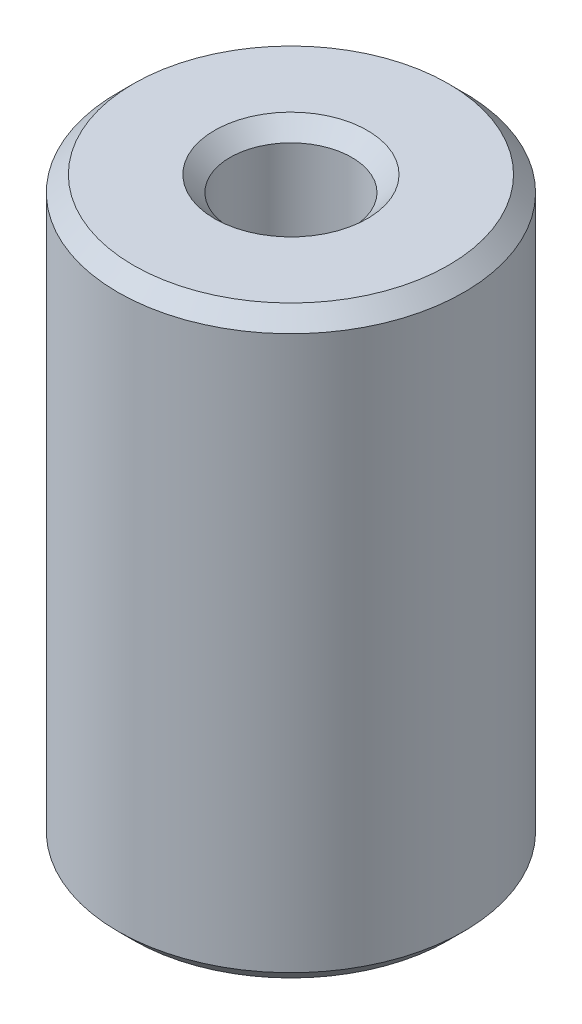
ISO-10303-21;
HEADER;
FILE_DESCRIPTION(('STEP AP214'),'2;1');
FILE_NAME('part.step','',(''),(''),'','','');
FILE_SCHEMA(('AUTOMOTIVE_DESIGN { 1 0 10303 214 1 1 1 1 }'));
ENDSEC;
DATA;
#1=APPLICATION_CONTEXT('core data for automotive mechanical design processes');
#2=APPLICATION_PROTOCOL_DEFINITION('international standard','automotive_design',2000,#1);
#3=PRODUCT_CONTEXT('',#1,'mechanical');
#4=PRODUCT('Part','Part','',(#3));
#5=PRODUCT_RELATED_PRODUCT_CATEGORY('part','',(#4));
#6=PRODUCT_DEFINITION_FORMATION('','',#4);
#7=PRODUCT_DEFINITION_CONTEXT('part definition',#1,'design');
#8=PRODUCT_DEFINITION('design','',#6,#7);
#9=PRODUCT_DEFINITION_SHAPE('','',#8);
#10=(LENGTH_UNIT() NAMED_UNIT(*) SI_UNIT(.MILLI.,.METRE.));
#11=(NAMED_UNIT(*) PLANE_ANGLE_UNIT() SI_UNIT($,.RADIAN.));
#12=(NAMED_UNIT(*) SI_UNIT($,.STERADIAN.) SOLID_ANGLE_UNIT());
#13=UNCERTAINTY_MEASURE_WITH_UNIT(LENGTH_MEASURE(1.E-05),#10,'distance_accuracy_value','');
#14=(GEOMETRIC_REPRESENTATION_CONTEXT(3) GLOBAL_UNCERTAINTY_ASSIGNED_CONTEXT((#13)) GLOBAL_UNIT_ASSIGNED_CONTEXT((#10,
#11,#12)) REPRESENTATION_CONTEXT('',''));
#15=CARTESIAN_POINT('',(0.,0.,0.));
#16=DIRECTION('',(0.,0.,1.));
#17=DIRECTION('',(1.,0.,0.));
#18=AXIS2_PLACEMENT_3D('',#15,#16,#17);
#19=CARTESIAN_POINT('',(0.,16.8949019545531,0.));
#20=DIRECTION('',(0.,-1.,0.));
#21=DIRECTION('',(0.,0.,-1.));
#22=AXIS2_PLACEMENT_3D('',#19,#20,#21);
#23=CYLINDRICAL_SURFACE('',#22,5.);
#24=CARTESIAN_POINT('',(0.,0.450390786111501,0.));
#25=DIRECTION('',(0.,1.,0.));
#26=DIRECTION('',(0.,0.,1.));
#27=AXIS2_PLACEMENT_3D('',#24,#25,#26);
#28=CIRCLE('',#27,5.);
#29=CARTESIAN_POINT('',(0.,0.450390786111501,5.));
#30=VERTEX_POINT('',#29);
#31=EDGE_CURVE('E10',#30,#30,#28,.T.);
#32=ORIENTED_EDGE('',*,*,#31,.T.);
#33=EDGE_LOOP('',(#32));
#34=FACE_BOUND('',#33,.T.);
#35=CARTESIAN_POINT('',(0.,16.4445111684416,0.));
#36=DIRECTION('',(0.,1.,0.));
#37=DIRECTION('',(0.,0.,1.));
#38=AXIS2_PLACEMENT_3D('',#35,#36,#37);
#39=CIRCLE('',#38,5.);
#40=CARTESIAN_POINT('',(0.,16.4445111684416,5.));
#41=VERTEX_POINT('',#40);
#42=EDGE_CURVE('E50',#41,#41,#39,.F.);
#43=ORIENTED_EDGE('',*,*,#42,.T.);
#44=EDGE_LOOP('',(#43));
#45=FACE_BOUND('',#44,.T.);
#46=ADVANCED_FACE('F39',(#34,#45),#23,.T.);
#47=CARTESIAN_POINT('',(0.,16.8949019545531,0.));
#48=DIRECTION('',(0.,1.,0.));
#49=DIRECTION('',(0.,0.,1.));
#50=AXIS2_PLACEMENT_3D('',#47,#48,#49);
#51=PLANE('',#50);
#52=CARTESIAN_POINT('',(0.,16.8949019545531,0.));
#53=DIRECTION('',(0.,1.,0.));
#54=DIRECTION('',(0.,0.,1.));
#55=AXIS2_PLACEMENT_3D('',#52,#53,#54);
#56=CIRCLE('',#55,2.20968163826328);
#57=CARTESIAN_POINT('',(0.,16.8949019545531,2.20968163826328));
#58=VERTEX_POINT('',#57);
#59=EDGE_CURVE('E58',#58,#58,#56,.F.);
#60=ORIENTED_EDGE('',*,*,#59,.T.);
#61=EDGE_LOOP('',(#60));
#62=FACE_BOUND('',#61,.T.);
#63=CARTESIAN_POINT('',(0.,16.8949019545531,0.));
#64=DIRECTION('',(0.,1.,0.));
#65=DIRECTION('',(0.,0.,1.));
#66=AXIS2_PLACEMENT_3D('',#63,#64,#65);
#67=CIRCLE('',#66,4.5496092138885);
#68=CARTESIAN_POINT('',(0.,16.8949019545531,4.5496092138885));
#69=VERTEX_POINT('',#68);
#70=EDGE_CURVE('E61',#69,#69,#67,.T.);
#71=ORIENTED_EDGE('',*,*,#70,.T.);
#72=EDGE_LOOP('',(#71));
#73=FACE_BOUND('',#72,.T.);
#74=ADVANCED_FACE('F88',(#62,#73),#51,.T.);
#75=CARTESIAN_POINT('',(0.,0.,0.));
#76=DIRECTION('',(0.,1.,0.));
#77=DIRECTION('',(0.,0.,1.));
#78=AXIS2_PLACEMENT_3D('',#75,#76,#77);
#79=PLANE('',#78);
#80=CARTESIAN_POINT('',(0.,0.,0.));
#81=DIRECTION('',(0.,1.,0.));
#82=DIRECTION('',(0.,0.,1.));
#83=AXIS2_PLACEMENT_3D('',#80,#81,#82);
#84=CIRCLE('',#83,2.20968163826329);
#85=CARTESIAN_POINT('',(0.,0.,2.20968163826329));
#86=VERTEX_POINT('',#85);
#87=EDGE_CURVE('E51',#86,#86,#84,.T.);
#88=ORIENTED_EDGE('',*,*,#87,.T.);
#89=EDGE_LOOP('',(#88));
#90=FACE_BOUND('',#89,.T.);
#91=CARTESIAN_POINT('',(0.,0.,0.));
#92=DIRECTION('',(0.,1.,0.));
#93=DIRECTION('',(0.,0.,1.));
#94=AXIS2_PLACEMENT_3D('',#91,#92,#93);
#95=CIRCLE('',#94,4.5496092138885);
#96=CARTESIAN_POINT('',(0.,0.,4.5496092138885));
#97=VERTEX_POINT('',#96);
#98=EDGE_CURVE('E54',#97,#97,#95,.F.);
#99=ORIENTED_EDGE('',*,*,#98,.T.);
#100=EDGE_LOOP('',(#99));
#101=FACE_BOUND('',#100,.T.);
#102=ADVANCED_FACE('F83',(#90,#101),#79,.F.);
#103=CARTESIAN_POINT('',(0.,16.8949019545531,0.));
#104=DIRECTION('',(0.,-1.,0.));
#105=DIRECTION('',(0.,0.,-1.));
#106=AXIS2_PLACEMENT_3D('',#103,#104,#105);
#107=CYLINDRICAL_SURFACE('',#106,1.75929085215178);
#108=CARTESIAN_POINT('',(0.,16.4445111684416,0.));
#109=DIRECTION('',(0.,1.,0.));
#110=DIRECTION('',(0.,0.,1.));
#111=AXIS2_PLACEMENT_3D('',#108,#109,#110);
#112=CIRCLE('',#111,1.75929085215178);
#113=CARTESIAN_POINT('',(0.,16.4445111684416,1.75929085215178));
#114=VERTEX_POINT('',#113);
#115=EDGE_CURVE('E67',#114,#114,#112,.T.);
#116=ORIENTED_EDGE('',*,*,#115,.T.);
#117=EDGE_LOOP('',(#116));
#118=FACE_BOUND('',#117,.T.);
#119=CARTESIAN_POINT('',(0.,0.450390786111508,0.));
#120=DIRECTION('',(0.,1.,0.));
#121=DIRECTION('',(0.,0.,1.));
#122=AXIS2_PLACEMENT_3D('',#119,#120,#121);
#123=CIRCLE('',#122,1.75929085215178);
#124=CARTESIAN_POINT('',(0.,0.450390786111508,1.75929085215178));
#125=VERTEX_POINT('',#124);
#126=EDGE_CURVE('E69',#125,#125,#123,.F.);
#127=ORIENTED_EDGE('',*,*,#126,.T.);
#128=EDGE_LOOP('',(#127));
#129=FACE_BOUND('',#128,.T.);
#130=ADVANCED_FACE('F71',(#118,#129),#107,.F.);
#131=CARTESIAN_POINT('',(0.,16.4445111684416,0.));
#132=DIRECTION('',(0.,1.,0.));
#133=DIRECTION('',(0.,0.,1.));
#134=AXIS2_PLACEMENT_3D('',#131,#132,#133);
#135=CONICAL_SURFACE('',#134,1.75929085215178,0.785398163397447);
#136=ORIENTED_EDGE('',*,*,#59,.F.);
#137=EDGE_LOOP('',(#136));
#138=FACE_BOUND('',#137,.T.);
#139=ORIENTED_EDGE('',*,*,#115,.F.);
#140=EDGE_LOOP('',(#139));
#141=FACE_BOUND('',#140,.T.);
#142=ADVANCED_FACE('F77',(#138,#141),#135,.F.);
#143=CARTESIAN_POINT('',(0.,0.,0.));
#144=DIRECTION('',(0.,-1.,0.));
#145=DIRECTION('',(0.,0.,-1.));
#146=AXIS2_PLACEMENT_3D('',#143,#144,#145);
#147=CONICAL_SURFACE('',#146,2.20968163826329,0.785398163397449);
#148=ORIENTED_EDGE('',*,*,#126,.F.);
#149=EDGE_LOOP('',(#148));
#150=FACE_BOUND('',#149,.T.);
#151=ORIENTED_EDGE('',*,*,#87,.F.);
#152=EDGE_LOOP('',(#151));
#153=FACE_BOUND('',#152,.T.);
#154=ADVANCED_FACE('F73',(#150,#153),#147,.F.);
#155=CARTESIAN_POINT('',(0.,0.450390786111501,0.));
#156=DIRECTION('',(0.,1.,0.));
#157=DIRECTION('',(0.,0.,1.));
#158=AXIS2_PLACEMENT_3D('',#155,#156,#157);
#159=CONICAL_SURFACE('',#158,5.,0.785398163397451);
#160=CARTESIAN_POINT('',(0.,0.,4.5496092138885));
#161=CARTESIAN_POINT('',(0.,0.00469157068866142,4.55430078457716));
#162=CARTESIAN_POINT('',(0.,0.00938314137732288,4.55899235526582));
#163=CARTESIAN_POINT('',(0.,0.0187662827546458,4.56837549664314));
#164=CARTESIAN_POINT('',(0.,0.0234578534433073,4.5730670673318));
#165=CARTESIAN_POINT('',(0.,0.0328409948206302,4.58245020870913));
#166=CARTESIAN_POINT('',(0.,0.0375325655092917,4.58714177939779));
#167=CARTESIAN_POINT('',(0.,0.0469157068866146,4.59652492077511));
#168=CARTESIAN_POINT('',(0.,0.0516072775752761,4.60121649146377));
#169=CARTESIAN_POINT('',(0.,0.060990418952599,4.6105996328411));
#170=CARTESIAN_POINT('',(0.,0.0656819896412605,4.61529120352976));
#171=CARTESIAN_POINT('',(0.,0.0750651310185834,4.62467434490708));
#172=CARTESIAN_POINT('',(0.,0.0797567017072449,4.62936591559574));
#173=CARTESIAN_POINT('',(0.,0.0891398430845678,4.63874905697307));
#174=CARTESIAN_POINT('',(0.,0.0938314137732293,4.64344062766173));
#175=CARTESIAN_POINT('',(0.,0.103214555150552,4.65282376903905));
#176=CARTESIAN_POINT('',(0.,0.107906125839214,4.65751533972771));
#177=CARTESIAN_POINT('',(0.,0.117289267216537,4.66689848110503));
#178=CARTESIAN_POINT('',(0.,0.121980837905198,4.6715900517937));
#179=CARTESIAN_POINT('',(0.,0.131363979282521,4.68097319317102));
#180=CARTESIAN_POINT('',(0.,0.136055549971182,4.68566476385968));
#181=CARTESIAN_POINT('',(0.,0.145438691348505,4.695047905237));
#182=CARTESIAN_POINT('',(0.,0.150130262037167,4.69973947592567));
#183=CARTESIAN_POINT('',(0.,0.15951340341449,4.70912261730299));
#184=CARTESIAN_POINT('',(0.,0.164204974103151,4.71381418799165));
#185=CARTESIAN_POINT('',(0.,0.173588115480474,4.72319732936897));
#186=CARTESIAN_POINT('',(0.,0.178279686169136,4.72788890005763));
#187=CARTESIAN_POINT('',(0.,0.187662827546459,4.73727204143496));
#188=CARTESIAN_POINT('',(0.,0.19235439823512,4.74196361212362));
#189=CARTESIAN_POINT('',(0.,0.201737539612443,4.75134675350094));
#190=CARTESIAN_POINT('',(0.,0.206429110301104,4.7560383241896));
#191=CARTESIAN_POINT('',(0.,0.215812251678427,4.76542146556693));
#192=CARTESIAN_POINT('',(0.,0.220503822367089,4.77011303625559));
#193=CARTESIAN_POINT('',(0.,0.229886963744412,4.77949617763291));
#194=CARTESIAN_POINT('',(0.,0.234578534433073,4.78418774832157));
#195=CARTESIAN_POINT('',(0.,0.243961675810396,4.79357088969889));
#196=CARTESIAN_POINT('',(0.,0.248653246499058,4.79826246038756));
#197=CARTESIAN_POINT('',(0.,0.258036387876381,4.80764560176488));
#198=CARTESIAN_POINT('',(0.,0.262727958565042,4.81233717245354));
#199=CARTESIAN_POINT('',(0.,0.272111099942365,4.82172031383086));
#200=CARTESIAN_POINT('',(0.,0.276802670631026,4.82641188451952));
#201=CARTESIAN_POINT('',(0.,0.286185812008349,4.83579502589685));
#202=CARTESIAN_POINT('',(0.,0.290877382697011,4.84048659658551));
#203=CARTESIAN_POINT('',(0.,0.300260524074334,4.84986973796283));
#204=CARTESIAN_POINT('',(0.,0.304952094762995,4.85456130865149));
#205=CARTESIAN_POINT('',(0.,0.314335236140318,4.86394445002882));
#206=CARTESIAN_POINT('',(0.,0.31902680682898,4.86863602071748));
#207=CARTESIAN_POINT('',(0.,0.328409948206303,4.8780191620948));
#208=CARTESIAN_POINT('',(0.,0.333101518894964,4.88271073278346));
#209=CARTESIAN_POINT('',(0.,0.342484660272287,4.89209387416079));
#210=CARTESIAN_POINT('',(0.,0.347176230960948,4.89678544484945));
#211=CARTESIAN_POINT('',(0.,0.356559372338271,4.90616858622677));
#212=CARTESIAN_POINT('',(0.,0.361250943026933,4.91086015691543));
#213=CARTESIAN_POINT('',(0.,0.370634084404256,4.92024329829275));
#214=CARTESIAN_POINT('',(0.,0.375325655092917,4.92493486898142));
#215=CARTESIAN_POINT('',(0.,0.38470879647024,4.93431801035874));
#216=CARTESIAN_POINT('',(0.,0.389400367158902,4.9390095810474));
#217=CARTESIAN_POINT('',(0.,0.398783508536225,4.94839272242472));
#218=CARTESIAN_POINT('',(0.,0.403475079224886,4.95308429311338));
#219=CARTESIAN_POINT('',(0.,0.412858220602209,4.96246743449071));
#220=CARTESIAN_POINT('',(0.,0.41754979129087,4.96715900517937));
#221=CARTESIAN_POINT('',(0.,0.426932932668193,4.97654214655669));
#222=CARTESIAN_POINT('',(0.,0.431624503356855,4.98123371724535));
#223=CARTESIAN_POINT('',(0.,0.441007644734178,4.99061685862268));
#224=CARTESIAN_POINT('',(0.,0.445699215422839,4.99530842931134));
#225=CARTESIAN_POINT('',(0.,0.450390786111501,5.));
#226=B_SPLINE_CURVE_WITH_KNOTS('',3,(#160,#161,#162,#163,#164,#165,#166,#167,#168,#169,#170,
#171,#172,#173,#174,#175,#176,#177,#178,#179,#180,#181,#182,#183,#184,#185,#186,#187,#188,#189,
#190,#191,#192,#193,#194,#195,#196,#197,#198,#199,#200,#201,#202,#203,#204,#205,#206,#207,#208,
#209,#210,#211,#212,#213,#214,#215,#216,#217,#218,#219,#220,#221,#222,#223,#224,#225),
.UNSPECIFIED.,.F.,.F.,(4,2,2,2,2,2,2,2,2,2,2,2,2,2,2,2,2,2,2,2,2,2,2,2,2,2,2,2,2,2,2,2,4),(0.,
0.0199046486902115,0.0398092973804229,0.0597139460706344,0.0796185947608458,0.0995232434510573,
0.119427892141269,0.13933254083148,0.159237189521692,0.179141838211903,0.199046486902115,
0.218951135592326,0.238855784282538,0.258760432972749,0.27866508166296,0.298569730353171,
0.318474379043383,0.338379027733594,0.358283676423806,0.378188325114017,0.398092973804229,
0.41799762249444,0.437902271184652,0.457806919874863,0.477711568565074,0.497616217255286,
0.517520865945497,0.537425514635709,0.55733016332592,0.577234812016132,0.597139460706343,
0.617044109396554,0.636948758086766),.UNSPECIFIED.);
#227=EDGE_CURVE('BSEAM76',#97,#30,#226,.T.);
#228=ORIENTED_EDGE('',*,*,#98,.F.);
#229=ORIENTED_EDGE('',*,*,#31,.F.);
#230=ORIENTED_EDGE('',*,*,#227,.T.);
#231=ORIENTED_EDGE('',*,*,#227,.F.);
#232=EDGE_LOOP('',(#228,#230,#229,#231));
#233=FACE_BOUND('',#232,.T.);
#234=ADVANCED_FACE('F76',(#233),#159,.T.);
#235=CARTESIAN_POINT('',(0.,16.8949019545531,0.));
#236=DIRECTION('',(0.,-1.,0.));
#237=DIRECTION('',(0.,0.,-1.));
#238=AXIS2_PLACEMENT_3D('',#235,#236,#237);
#239=CONICAL_SURFACE('',#238,4.5496092138885,0.785398163397447);
#240=ORIENTED_EDGE('',*,*,#42,.F.);
#241=EDGE_LOOP('',(#240));
#242=FACE_BOUND('',#241,.T.);
#243=ORIENTED_EDGE('',*,*,#70,.F.);
#244=EDGE_LOOP('',(#243));
#245=FACE_BOUND('',#244,.T.);
#246=ADVANCED_FACE('F45',(#242,#245),#239,.T.);
#247=CLOSED_SHELL('',(#46,#74,#102,#130,#142,#154,#234,#246));
#248=MANIFOLD_SOLID_BREP('B2',#247);
#249=ADVANCED_BREP_SHAPE_REPRESENTATION('',(#18,#248),#14);
#250=SHAPE_DEFINITION_REPRESENTATION(#9,#249);
ENDSEC;
END-ISO-10303-21;
